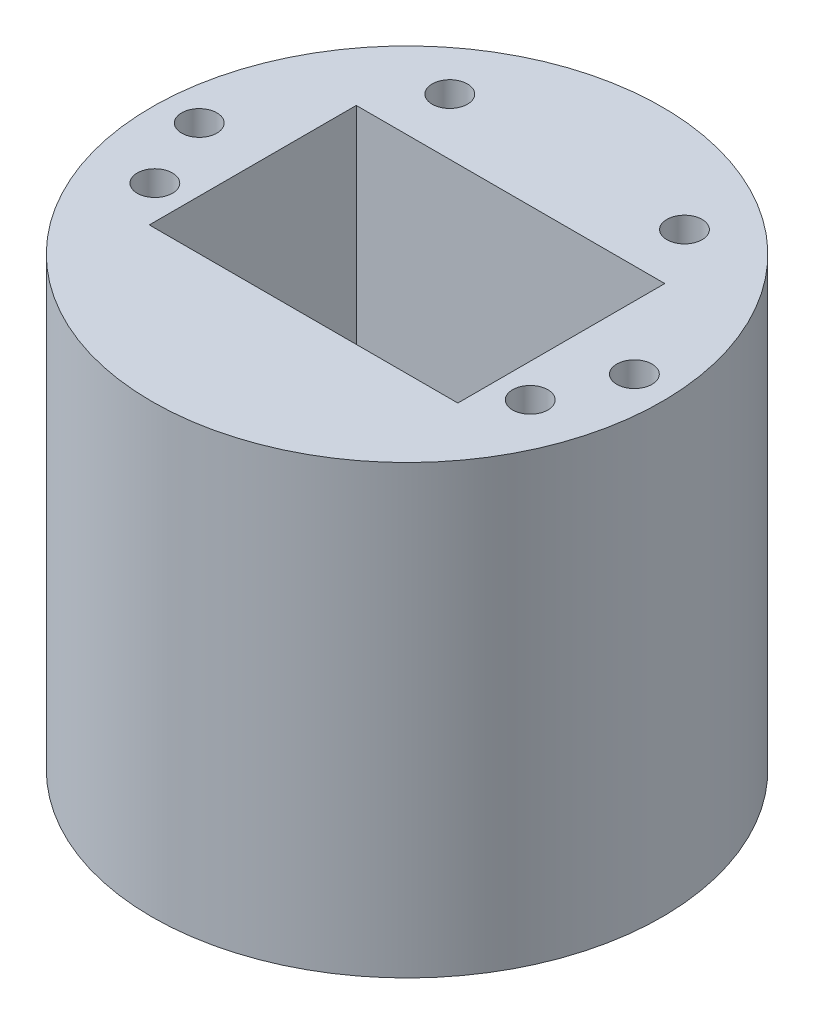
ISO-10303-21;
HEADER;
FILE_DESCRIPTION(('STEP AP214'),'2;1');
FILE_NAME('part.step','',(''),(''),'','','');
FILE_SCHEMA(('AUTOMOTIVE_DESIGN { 1 0 10303 214 1 1 1 1 }'));
ENDSEC;
DATA;
#1=APPLICATION_CONTEXT('core data for automotive mechanical design processes');
#2=APPLICATION_PROTOCOL_DEFINITION('international standard','automotive_design',2000,#1);
#3=PRODUCT_CONTEXT('',#1,'mechanical');
#4=PRODUCT('Part','Part','',(#3));
#5=PRODUCT_RELATED_PRODUCT_CATEGORY('part','',(#4));
#6=PRODUCT_DEFINITION_FORMATION('','',#4);
#7=PRODUCT_DEFINITION_CONTEXT('part definition',#1,'design');
#8=PRODUCT_DEFINITION('design','',#6,#7);
#9=PRODUCT_DEFINITION_SHAPE('','',#8);
#10=(LENGTH_UNIT() NAMED_UNIT(*) SI_UNIT(.MILLI.,.METRE.));
#11=(NAMED_UNIT(*) PLANE_ANGLE_UNIT() SI_UNIT($,.RADIAN.));
#12=(NAMED_UNIT(*) SI_UNIT($,.STERADIAN.) SOLID_ANGLE_UNIT());
#13=UNCERTAINTY_MEASURE_WITH_UNIT(LENGTH_MEASURE(1.E-05),#10,'distance_accuracy_value','');
#14=(GEOMETRIC_REPRESENTATION_CONTEXT(3) GLOBAL_UNCERTAINTY_ASSIGNED_CONTEXT((#13)) GLOBAL_UNIT_ASSIGNED_CONTEXT((#10,
#11,#12)) REPRESENTATION_CONTEXT('',''));
#15=CARTESIAN_POINT('',(0.,0.,0.));
#16=DIRECTION('',(0.,0.,1.));
#17=DIRECTION('',(1.,0.,0.));
#18=AXIS2_PLACEMENT_3D('',#15,#16,#17);
#19=CARTESIAN_POINT('',(37.0004748256233,88.,12.7186187483685));
#20=DIRECTION('',(0.,-1.,0.));
#21=DIRECTION('',(0.,0.,-1.));
#22=AXIS2_PLACEMENT_3D('',#19,#20,#21);
#23=CYLINDRICAL_SURFACE('',#22,3.475);
#24=CARTESIAN_POINT('',(37.0004748256233,88.,12.7186187483685));
#25=DIRECTION('',(0.,1.,0.));
#26=DIRECTION('',(0.,0.,1.));
#27=AXIS2_PLACEMENT_3D('',#24,#25,#26);
#28=CIRCLE('',#27,3.475);
#29=CARTESIAN_POINT('',(37.0004748256233,88.,16.1936187483685));
#30=VERTEX_POINT('',#29);
#31=EDGE_CURVE('E50',#30,#30,#28,.F.);
#32=ORIENTED_EDGE('',*,*,#31,.F.);
#33=EDGE_LOOP('',(#32));
#34=FACE_BOUND('',#33,.T.);
#35=CARTESIAN_POINT('',(37.0004748256233,0.,12.7186187483685));
#36=DIRECTION('',(0.,1.,0.));
#37=DIRECTION('',(0.,0.,1.));
#38=AXIS2_PLACEMENT_3D('',#35,#36,#37);
#39=CIRCLE('',#38,3.475);
#40=CARTESIAN_POINT('',(37.0004748256233,0.,16.1936187483685));
#41=VERTEX_POINT('',#40);
#42=EDGE_CURVE('E207',#41,#41,#39,.F.);
#43=ORIENTED_EDGE('',*,*,#42,.T.);
#44=EDGE_LOOP('',(#43));
#45=FACE_BOUND('',#44,.T.);
#46=ADVANCED_FACE('F41',(#34,#45),#23,.F.);
#47=CARTESIAN_POINT('',(-23.1297303627879,88.,-31.5565203013999));
#48=DIRECTION('',(0.,-1.,0.));
#49=DIRECTION('',(0.,0.,-1.));
#50=AXIS2_PLACEMENT_3D('',#47,#48,#49);
#51=CYLINDRICAL_SURFACE('',#50,3.475);
#52=CARTESIAN_POINT('',(-23.1297303627879,88.,-31.5565203013999));
#53=DIRECTION('',(0.,1.,0.));
#54=DIRECTION('',(0.,0.,1.));
#55=AXIS2_PLACEMENT_3D('',#52,#53,#54);
#56=CIRCLE('',#55,3.475);
#57=CARTESIAN_POINT('',(-23.1297303627879,88.,-28.0815203013999));
#58=VERTEX_POINT('',#57);
#59=EDGE_CURVE('E189',#58,#58,#56,.T.);
#60=ORIENTED_EDGE('',*,*,#59,.T.);
#61=EDGE_LOOP('',(#60));
#62=FACE_BOUND('',#61,.T.);
#63=CARTESIAN_POINT('',(-23.1297303627879,0.,-31.5565203013999));
#64=DIRECTION('',(0.,1.,0.));
#65=DIRECTION('',(0.,0.,1.));
#66=AXIS2_PLACEMENT_3D('',#63,#64,#65);
#67=CIRCLE('',#66,3.475);
#68=CARTESIAN_POINT('',(-23.1297303627879,0.,-28.0815203013999));
#69=VERTEX_POINT('',#68);
#70=EDGE_CURVE('E205',#69,#69,#67,.T.);
#71=ORIENTED_EDGE('',*,*,#70,.F.);
#72=EDGE_LOOP('',(#71));
#73=FACE_BOUND('',#72,.T.);
#74=ADVANCED_FACE('F235',(#62,#73),#51,.F.);
#75=CARTESIAN_POINT('',(-37.0004748256233,88.,12.7186187483685));
#76=DIRECTION('',(0.,-1.,0.));
#77=DIRECTION('',(0.,0.,-1.));
#78=AXIS2_PLACEMENT_3D('',#75,#76,#77);
#79=CYLINDRICAL_SURFACE('',#78,3.475);
#80=CARTESIAN_POINT('',(-37.0004748256233,88.,12.7186187483685));
#81=DIRECTION('',(0.,1.,0.));
#82=DIRECTION('',(0.,0.,1.));
#83=AXIS2_PLACEMENT_3D('',#80,#81,#82);
#84=CIRCLE('',#83,3.475);
#85=CARTESIAN_POINT('',(-37.0004748256233,88.,16.1936187483685));
#86=VERTEX_POINT('',#85);
#87=EDGE_CURVE('E186',#86,#86,#84,.T.);
#88=ORIENTED_EDGE('',*,*,#87,.T.);
#89=EDGE_LOOP('',(#88));
#90=FACE_BOUND('',#89,.T.);
#91=CARTESIAN_POINT('',(-37.0004748256233,0.,12.7186187483685));
#92=DIRECTION('',(0.,1.,0.));
#93=DIRECTION('',(0.,0.,1.));
#94=AXIS2_PLACEMENT_3D('',#91,#92,#93);
#95=CIRCLE('',#94,3.475);
#96=CARTESIAN_POINT('',(-37.0004748256233,0.,16.1936187483685));
#97=VERTEX_POINT('',#96);
#98=EDGE_CURVE('E202',#97,#97,#95,.T.);
#99=ORIENTED_EDGE('',*,*,#98,.F.);
#100=EDGE_LOOP('',(#99));
#101=FACE_BOUND('',#100,.T.);
#102=ADVANCED_FACE('F241',(#90,#101),#79,.F.);
#103=CARTESIAN_POINT('',(-42.8868203559517,88.,-1.92497785865903));
#104=DIRECTION('',(0.,-1.,0.));
#105=DIRECTION('',(0.,0.,-1.));
#106=AXIS2_PLACEMENT_3D('',#103,#104,#105);
#107=CYLINDRICAL_SURFACE('',#106,3.475);
#108=CARTESIAN_POINT('',(-42.8868203559517,88.,-1.92497785865903));
#109=DIRECTION('',(0.,1.,0.));
#110=DIRECTION('',(0.,0.,1.));
#111=AXIS2_PLACEMENT_3D('',#108,#109,#110);
#112=CIRCLE('',#111,3.475);
#113=CARTESIAN_POINT('',(-42.8868203559517,88.,1.55002214134097));
#114=VERTEX_POINT('',#113);
#115=EDGE_CURVE('E183',#114,#114,#112,.T.);
#116=ORIENTED_EDGE('',*,*,#115,.T.);
#117=EDGE_LOOP('',(#116));
#118=FACE_BOUND('',#117,.T.);
#119=CARTESIAN_POINT('',(-42.8868203559517,0.,-1.92497785865903));
#120=DIRECTION('',(0.,1.,0.));
#121=DIRECTION('',(0.,0.,1.));
#122=AXIS2_PLACEMENT_3D('',#119,#120,#121);
#123=CIRCLE('',#122,3.475);
#124=CARTESIAN_POINT('',(-42.8868203559517,0.,1.55002214134097));
#125=VERTEX_POINT('',#124);
#126=EDGE_CURVE('E199',#125,#125,#123,.T.);
#127=ORIENTED_EDGE('',*,*,#126,.F.);
#128=EDGE_LOOP('',(#127));
#129=FACE_BOUND('',#128,.T.);
#130=ADVANCED_FACE('F248',(#118,#129),#107,.F.);
#131=CARTESIAN_POINT('',(0.,88.,0.));
#132=DIRECTION('',(0.,-1.,0.));
#133=DIRECTION('',(0.,0.,-1.));
#134=AXIS2_PLACEMENT_3D('',#131,#132,#133);
#135=CYLINDRICAL_SURFACE('',#134,50.292);
#136=CARTESIAN_POINT('',(0.,88.,0.));
#137=DIRECTION('',(0.,1.,0.));
#138=DIRECTION('',(0.,0.,1.));
#139=AXIS2_PLACEMENT_3D('',#136,#137,#138);
#140=CIRCLE('',#139,50.292);
#141=CARTESIAN_POINT('',(0.,88.,50.292));
#142=VERTEX_POINT('',#141);
#143=EDGE_CURVE('E180',#142,#142,#140,.T.);
#144=ORIENTED_EDGE('',*,*,#143,.F.);
#145=EDGE_LOOP('',(#144));
#146=FACE_BOUND('',#145,.T.);
#147=CARTESIAN_POINT('',(0.,0.,0.));
#148=DIRECTION('',(0.,1.,0.));
#149=DIRECTION('',(0.,0.,1.));
#150=AXIS2_PLACEMENT_3D('',#147,#148,#149);
#151=CIRCLE('',#150,50.292);
#152=CARTESIAN_POINT('',(0.,0.,50.292));
#153=VERTEX_POINT('',#152);
#154=EDGE_CURVE('E196',#153,#153,#151,.T.);
#155=ORIENTED_EDGE('',*,*,#154,.T.);
#156=EDGE_LOOP('',(#155));
#157=FACE_BOUND('',#156,.T.);
#158=ADVANCED_FACE('F251',(#146,#157),#135,.T.);
#159=CARTESIAN_POINT('',(42.8868203559517,88.,-1.92497785865903));
#160=DIRECTION('',(0.,-1.,0.));
#161=DIRECTION('',(0.,0.,-1.));
#162=AXIS2_PLACEMENT_3D('',#159,#160,#161);
#163=CYLINDRICAL_SURFACE('',#162,3.475);
#164=CARTESIAN_POINT('',(42.8868203559517,88.,-1.92497785865903));
#165=DIRECTION('',(0.,1.,0.));
#166=DIRECTION('',(0.,0.,1.));
#167=AXIS2_PLACEMENT_3D('',#164,#165,#166);
#168=CIRCLE('',#167,3.475);
#169=CARTESIAN_POINT('',(42.8868203559517,88.,1.55002214134097));
#170=VERTEX_POINT('',#169);
#171=EDGE_CURVE('E177',#170,#170,#168,.F.);
#172=ORIENTED_EDGE('',*,*,#171,.F.);
#173=EDGE_LOOP('',(#172));
#174=FACE_BOUND('',#173,.T.);
#175=CARTESIAN_POINT('',(42.8868203559517,0.,-1.92497785865903));
#176=DIRECTION('',(0.,1.,0.));
#177=DIRECTION('',(0.,0.,1.));
#178=AXIS2_PLACEMENT_3D('',#175,#176,#177);
#179=CIRCLE('',#178,3.475);
#180=CARTESIAN_POINT('',(42.8868203559517,0.,1.55002214134097));
#181=VERTEX_POINT('',#180);
#182=EDGE_CURVE('E171',#181,#181,#179,.F.);
#183=ORIENTED_EDGE('',*,*,#182,.T.);
#184=EDGE_LOOP('',(#183));
#185=FACE_BOUND('',#184,.T.);
#186=ADVANCED_FACE('F43',(#174,#185),#163,.F.);
#187=CARTESIAN_POINT('',(23.1297303627879,88.,-31.5565203013999));
#188=DIRECTION('',(0.,-1.,0.));
#189=DIRECTION('',(0.,0.,-1.));
#190=AXIS2_PLACEMENT_3D('',#187,#188,#189);
#191=CYLINDRICAL_SURFACE('',#190,3.475);
#192=CARTESIAN_POINT('',(23.1297303627879,88.,-31.5565203013999));
#193=DIRECTION('',(0.,1.,0.));
#194=DIRECTION('',(0.,0.,1.));
#195=AXIS2_PLACEMENT_3D('',#192,#193,#194);
#196=CIRCLE('',#195,3.475);
#197=CARTESIAN_POINT('',(23.1297303627879,88.,-28.0815203013999));
#198=VERTEX_POINT('',#197);
#199=EDGE_CURVE('E11',#198,#198,#196,.F.);
#200=ORIENTED_EDGE('',*,*,#199,.F.);
#201=EDGE_LOOP('',(#200));
#202=FACE_BOUND('',#201,.T.);
#203=CARTESIAN_POINT('',(23.1297303627879,0.,-31.5565203013999));
#204=DIRECTION('',(0.,1.,0.));
#205=DIRECTION('',(0.,0.,1.));
#206=AXIS2_PLACEMENT_3D('',#203,#204,#205);
#207=CIRCLE('',#206,3.475);
#208=CARTESIAN_POINT('',(23.1297303627879,0.,-28.0815203013999));
#209=VERTEX_POINT('',#208);
#210=EDGE_CURVE('E45',#209,#209,#207,.F.);
#211=ORIENTED_EDGE('',*,*,#210,.T.);
#212=EDGE_LOOP('',(#211));
#213=FACE_BOUND('',#212,.T.);
#214=ADVANCED_FACE('F214',(#202,#213),#191,.F.);
#215=CARTESIAN_POINT('',(0.,88.,0.));
#216=DIRECTION('',(0.,1.,0.));
#217=DIRECTION('',(0.,0.,1.));
#218=AXIS2_PLACEMENT_3D('',#215,#216,#217);
#219=PLANE('',#218);
#220=DIRECTION('',(-1.,0.,0.));
#221=VECTOR('',#220,1.);
#222=CARTESIAN_POINT('',(30.411054643993,88.,-20.400011123166));
#223=LINE('',#222,#221);
#224=CARTESIAN_POINT('',(30.411054643993,88.,-20.400011123166));
#225=VERTEX_POINT('',#224);
#226=CARTESIAN_POINT('',(-30.411054643993,88.,-20.400011123166));
#227=VERTEX_POINT('',#226);
#228=EDGE_CURVE('E66',#225,#227,#223,.T.);
#229=ORIENTED_EDGE('',*,*,#228,.F.);
#230=DIRECTION('',(0.,0.,-1.));
#231=VECTOR('',#230,1.);
#232=CARTESIAN_POINT('',(30.411054643993,88.,20.400011123166));
#233=LINE('',#232,#231);
#234=CARTESIAN_POINT('',(30.411054643993,88.,20.400011123166));
#235=VERTEX_POINT('',#234);
#236=EDGE_CURVE('E150',#235,#225,#233,.T.);
#237=ORIENTED_EDGE('',*,*,#236,.F.);
#238=DIRECTION('',(1.,0.,0.));
#239=VECTOR('',#238,1.);
#240=CARTESIAN_POINT('',(-30.411054643993,88.,20.400011123166));
#241=LINE('',#240,#239);
#242=CARTESIAN_POINT('',(-30.411054643993,88.,20.400011123166));
#243=VERTEX_POINT('',#242);
#244=EDGE_CURVE('E164',#243,#235,#241,.T.);
#245=ORIENTED_EDGE('',*,*,#244,.F.);
#246=DIRECTION('',(0.,0.,1.));
#247=VECTOR('',#246,1.);
#248=CARTESIAN_POINT('',(-30.411054643993,88.,-20.400011123166));
#249=LINE('',#248,#247);
#250=EDGE_CURVE('E161',#227,#243,#249,.T.);
#251=ORIENTED_EDGE('',*,*,#250,.F.);
#252=EDGE_LOOP('',(#229,#237,#245,#251));
#253=FACE_BOUND('',#252,.T.);
#254=ORIENTED_EDGE('',*,*,#171,.T.);
#255=EDGE_LOOP('',(#254));
#256=FACE_BOUND('',#255,.T.);
#257=ORIENTED_EDGE('',*,*,#143,.T.);
#258=EDGE_LOOP('',(#257));
#259=FACE_BOUND('',#258,.T.);
#260=ORIENTED_EDGE('',*,*,#115,.F.);
#261=EDGE_LOOP('',(#260));
#262=FACE_BOUND('',#261,.T.);
#263=ORIENTED_EDGE('',*,*,#87,.F.);
#264=EDGE_LOOP('',(#263));
#265=FACE_BOUND('',#264,.T.);
#266=ORIENTED_EDGE('',*,*,#59,.F.);
#267=EDGE_LOOP('',(#266));
#268=FACE_BOUND('',#267,.T.);
#269=ORIENTED_EDGE('',*,*,#31,.T.);
#270=EDGE_LOOP('',(#269));
#271=FACE_BOUND('',#270,.T.);
#272=ORIENTED_EDGE('',*,*,#199,.T.);
#273=EDGE_LOOP('',(#272));
#274=FACE_BOUND('',#273,.T.);
#275=ADVANCED_FACE('F219',(#253,#256,#259,#262,#265,#268,#271,#274),#219,.T.);
#276=CARTESIAN_POINT('',(0.,0.,0.));
#277=DIRECTION('',(0.,1.,0.));
#278=DIRECTION('',(0.,0.,1.));
#279=AXIS2_PLACEMENT_3D('',#276,#277,#278);
#280=PLANE('',#279);
#281=DIRECTION('',(-1.,0.,0.));
#282=VECTOR('',#281,1.);
#283=CARTESIAN_POINT('',(-24.5095333354755,0.,10.4238141839846));
#284=LINE('',#283,#282);
#285=CARTESIAN_POINT('',(24.5095333354755,0.,10.4238141839846));
#286=VERTEX_POINT('',#285);
#287=CARTESIAN_POINT('',(-24.5095333354755,0.,10.4238141839846));
#288=VERTEX_POINT('',#287);
#289=EDGE_CURVE('E137',#286,#288,#284,.T.);
#290=ORIENTED_EDGE('',*,*,#289,.F.);
#291=DIRECTION('',(0.,0.,1.));
#292=VECTOR('',#291,1.);
#293=CARTESIAN_POINT('',(24.5095333354755,0.,-10.4238141839846));
#294=LINE('',#293,#292);
#295=CARTESIAN_POINT('',(24.5095333354755,0.,-10.4238141839846));
#296=VERTEX_POINT('',#295);
#297=EDGE_CURVE('E58',#296,#286,#294,.T.);
#298=ORIENTED_EDGE('',*,*,#297,.F.);
#299=DIRECTION('',(1.,0.,0.));
#300=VECTOR('',#299,1.);
#301=CARTESIAN_POINT('',(-24.5095333354755,0.,-10.4238141839846));
#302=LINE('',#301,#300);
#303=CARTESIAN_POINT('',(-24.5095333354755,0.,-10.4238141839846));
#304=VERTEX_POINT('',#303);
#305=EDGE_CURVE('E128',#304,#296,#302,.T.);
#306=ORIENTED_EDGE('',*,*,#305,.F.);
#307=DIRECTION('',(0.,0.,-1.));
#308=VECTOR('',#307,1.);
#309=CARTESIAN_POINT('',(-24.5095333354755,0.,-10.4238141839846));
#310=LINE('',#309,#308);
#311=EDGE_CURVE('E131',#288,#304,#310,.T.);
#312=ORIENTED_EDGE('',*,*,#311,.F.);
#313=EDGE_LOOP('',(#290,#298,#306,#312));
#314=FACE_BOUND('',#313,.T.);
#315=ORIENTED_EDGE('',*,*,#182,.F.);
#316=EDGE_LOOP('',(#315));
#317=FACE_BOUND('',#316,.T.);
#318=ORIENTED_EDGE('',*,*,#154,.F.);
#319=EDGE_LOOP('',(#318));
#320=FACE_BOUND('',#319,.T.);
#321=ORIENTED_EDGE('',*,*,#126,.T.);
#322=EDGE_LOOP('',(#321));
#323=FACE_BOUND('',#322,.T.);
#324=ORIENTED_EDGE('',*,*,#98,.T.);
#325=EDGE_LOOP('',(#324));
#326=FACE_BOUND('',#325,.T.);
#327=ORIENTED_EDGE('',*,*,#70,.T.);
#328=EDGE_LOOP('',(#327));
#329=FACE_BOUND('',#328,.T.);
#330=ORIENTED_EDGE('',*,*,#42,.F.);
#331=EDGE_LOOP('',(#330));
#332=FACE_BOUND('',#331,.T.);
#333=ORIENTED_EDGE('',*,*,#210,.F.);
#334=EDGE_LOOP('',(#333));
#335=FACE_BOUND('',#334,.T.);
#336=ADVANCED_FACE('F216',(#314,#317,#320,#323,#326,#329,#332,#335),#280,.F.);
#337=CARTESIAN_POINT('',(30.411054643993,19.96,-20.400011123166));
#338=DIRECTION('',(0.,0.,-1.));
#339=DIRECTION('',(-1.,0.,0.));
#340=AXIS2_PLACEMENT_3D('',#337,#338,#339);
#341=PLANE('',#340);
#342=ORIENTED_EDGE('',*,*,#228,.T.);
#343=DIRECTION('',(0.,1.,0.));
#344=VECTOR('',#343,1.);
#345=CARTESIAN_POINT('',(-30.411054643993,19.96,-20.400011123166));
#346=LINE('',#345,#344);
#347=CARTESIAN_POINT('',(-30.411054643993,19.96,-20.400011123166));
#348=VERTEX_POINT('',#347);
#349=EDGE_CURVE('E159',#348,#227,#346,.T.);
#350=ORIENTED_EDGE('',*,*,#349,.F.);
#351=DIRECTION('',(-1.,0.,0.));
#352=VECTOR('',#351,1.);
#353=CARTESIAN_POINT('',(30.411054643993,19.96,-20.400011123166));
#354=LINE('',#353,#352);
#355=CARTESIAN_POINT('',(30.411054643993,19.96,-20.400011123166));
#356=VERTEX_POINT('',#355);
#357=EDGE_CURVE('E146',#356,#348,#354,.T.);
#358=ORIENTED_EDGE('',*,*,#357,.F.);
#359=DIRECTION('',(0.,1.,0.));
#360=VECTOR('',#359,1.);
#361=CARTESIAN_POINT('',(30.411054643993,19.96,-20.400011123166));
#362=LINE('',#361,#360);
#363=EDGE_CURVE('E169',#356,#225,#362,.T.);
#364=ORIENTED_EDGE('',*,*,#363,.T.);
#365=EDGE_LOOP('',(#342,#350,#358,#364));
#366=FACE_BOUND('',#365,.T.);
#367=ADVANCED_FACE('F218',(#366),#341,.F.);
#368=CARTESIAN_POINT('',(30.411054643993,19.96,20.400011123166));
#369=DIRECTION('',(1.,0.,0.));
#370=DIRECTION('',(0.,0.,-1.));
#371=AXIS2_PLACEMENT_3D('',#368,#369,#370);
#372=PLANE('',#371);
#373=ORIENTED_EDGE('',*,*,#236,.T.);
#374=ORIENTED_EDGE('',*,*,#363,.F.);
#375=DIRECTION('',(0.,0.,-1.));
#376=VECTOR('',#375,1.);
#377=CARTESIAN_POINT('',(30.411054643993,19.96,20.400011123166));
#378=LINE('',#377,#376);
#379=CARTESIAN_POINT('',(30.411054643993,19.96,20.400011123166));
#380=VERTEX_POINT('',#379);
#381=EDGE_CURVE('E156',#380,#356,#378,.T.);
#382=ORIENTED_EDGE('',*,*,#381,.F.);
#383=DIRECTION('',(0.,1.,0.));
#384=VECTOR('',#383,1.);
#385=CARTESIAN_POINT('',(30.411054643993,19.96,20.400011123166));
#386=LINE('',#385,#384);
#387=EDGE_CURVE('E172',#380,#235,#386,.T.);
#388=ORIENTED_EDGE('',*,*,#387,.T.);
#389=EDGE_LOOP('',(#373,#374,#382,#388));
#390=FACE_BOUND('',#389,.T.);
#391=ADVANCED_FACE('F227',(#390),#372,.F.);
#392=CARTESIAN_POINT('',(-30.411054643993,19.96,20.400011123166));
#393=DIRECTION('',(0.,0.,1.));
#394=DIRECTION('',(1.,0.,0.));
#395=AXIS2_PLACEMENT_3D('',#392,#393,#394);
#396=PLANE('',#395);
#397=ORIENTED_EDGE('',*,*,#244,.T.);
#398=ORIENTED_EDGE('',*,*,#387,.F.);
#399=DIRECTION('',(1.,0.,0.));
#400=VECTOR('',#399,1.);
#401=CARTESIAN_POINT('',(-30.411054643993,19.96,20.400011123166));
#402=LINE('',#401,#400);
#403=CARTESIAN_POINT('',(-30.411054643993,19.96,20.400011123166));
#404=VERTEX_POINT('',#403);
#405=EDGE_CURVE('E153',#404,#380,#402,.T.);
#406=ORIENTED_EDGE('',*,*,#405,.F.);
#407=DIRECTION('',(0.,1.,0.));
#408=VECTOR('',#407,1.);
#409=CARTESIAN_POINT('',(-30.411054643993,19.96,20.400011123166));
#410=LINE('',#409,#408);
#411=EDGE_CURVE('E174',#404,#243,#410,.T.);
#412=ORIENTED_EDGE('',*,*,#411,.T.);
#413=EDGE_LOOP('',(#397,#398,#406,#412));
#414=FACE_BOUND('',#413,.T.);
#415=ADVANCED_FACE('F306',(#414),#396,.F.);
#416=CARTESIAN_POINT('',(-30.411054643993,19.96,-20.400011123166));
#417=DIRECTION('',(-1.,0.,0.));
#418=DIRECTION('',(0.,0.,1.));
#419=AXIS2_PLACEMENT_3D('',#416,#417,#418);
#420=PLANE('',#419);
#421=ORIENTED_EDGE('',*,*,#250,.T.);
#422=ORIENTED_EDGE('',*,*,#411,.F.);
#423=DIRECTION('',(0.,0.,1.));
#424=VECTOR('',#423,1.);
#425=CARTESIAN_POINT('',(-30.411054643993,19.96,-20.400011123166));
#426=LINE('',#425,#424);
#427=EDGE_CURVE('E149',#348,#404,#426,.T.);
#428=ORIENTED_EDGE('',*,*,#427,.F.);
#429=ORIENTED_EDGE('',*,*,#349,.T.);
#430=EDGE_LOOP('',(#421,#422,#428,#429));
#431=FACE_BOUND('',#430,.T.);
#432=ADVANCED_FACE('F315',(#431),#420,.F.);
#433=CARTESIAN_POINT('',(0.,19.96,0.));
#434=DIRECTION('',(0.,1.,0.));
#435=DIRECTION('',(0.,0.,1.));
#436=AXIS2_PLACEMENT_3D('',#433,#434,#435);
#437=PLANE('',#436);
#438=ORIENTED_EDGE('',*,*,#357,.T.);
#439=ORIENTED_EDGE('',*,*,#427,.T.);
#440=ORIENTED_EDGE('',*,*,#405,.T.);
#441=ORIENTED_EDGE('',*,*,#381,.T.);
#442=EDGE_LOOP('',(#438,#439,#440,#441));
#443=FACE_BOUND('',#442,.T.);
#444=ADVANCED_FACE('F323',(#443),#437,.T.);
#445=CARTESIAN_POINT('',(24.5095333354755,12.,-10.4238141839846));
#446=DIRECTION('',(1.,0.,0.));
#447=DIRECTION('',(0.,0.,-1.));
#448=AXIS2_PLACEMENT_3D('',#445,#446,#447);
#449=PLANE('',#448);
#450=ORIENTED_EDGE('',*,*,#297,.T.);
#451=DIRECTION('',(0.,-1.,0.));
#452=VECTOR('',#451,1.);
#453=CARTESIAN_POINT('',(24.5095333354755,12.,10.4238141839846));
#454=LINE('',#453,#452);
#455=CARTESIAN_POINT('',(24.5095333354755,12.,10.4238141839846));
#456=VERTEX_POINT('',#455);
#457=EDGE_CURVE('E106',#456,#286,#454,.T.);
#458=ORIENTED_EDGE('',*,*,#457,.F.);
#459=DIRECTION('',(0.,0.,1.));
#460=VECTOR('',#459,1.);
#461=CARTESIAN_POINT('',(24.5095333354755,12.,-10.4238141839846));
#462=LINE('',#461,#460);
#463=CARTESIAN_POINT('',(24.5095333354755,12.,-10.4238141839846));
#464=VERTEX_POINT('',#463);
#465=EDGE_CURVE('E110',#464,#456,#462,.T.);
#466=ORIENTED_EDGE('',*,*,#465,.F.);
#467=DIRECTION('',(0.,-1.,0.));
#468=VECTOR('',#467,1.);
#469=CARTESIAN_POINT('',(24.5095333354755,12.,-10.4238141839846));
#470=LINE('',#469,#468);
#471=EDGE_CURVE('E141',#464,#296,#470,.T.);
#472=ORIENTED_EDGE('',*,*,#471,.T.);
#473=EDGE_LOOP('',(#450,#458,#466,#472));
#474=FACE_BOUND('',#473,.T.);
#475=ADVANCED_FACE('F108',(#474),#449,.F.);
#476=CARTESIAN_POINT('',(-24.5095333354755,12.,-10.4238141839846));
#477=DIRECTION('',(0.,0.,-1.));
#478=DIRECTION('',(-1.,0.,0.));
#479=AXIS2_PLACEMENT_3D('',#476,#477,#478);
#480=PLANE('',#479);
#481=ORIENTED_EDGE('',*,*,#305,.T.);
#482=ORIENTED_EDGE('',*,*,#471,.F.);
#483=DIRECTION('',(1.,0.,0.));
#484=VECTOR('',#483,1.);
#485=CARTESIAN_POINT('',(-24.5095333354755,12.,-10.4238141839846));
#486=LINE('',#485,#484);
#487=CARTESIAN_POINT('',(-24.5095333354755,12.,-10.4238141839846));
#488=VERTEX_POINT('',#487);
#489=EDGE_CURVE('E116',#488,#464,#486,.T.);
#490=ORIENTED_EDGE('',*,*,#489,.F.);
#491=DIRECTION('',(0.,-1.,0.));
#492=VECTOR('',#491,1.);
#493=CARTESIAN_POINT('',(-24.5095333354755,12.,-10.4238141839846));
#494=LINE('',#493,#492);
#495=EDGE_CURVE('E143',#488,#304,#494,.T.);
#496=ORIENTED_EDGE('',*,*,#495,.T.);
#497=EDGE_LOOP('',(#481,#482,#490,#496));
#498=FACE_BOUND('',#497,.T.);
#499=ADVANCED_FACE('F342',(#498),#480,.F.);
#500=CARTESIAN_POINT('',(-24.5095333354755,12.,-10.4238141839846));
#501=DIRECTION('',(-1.,0.,0.));
#502=DIRECTION('',(0.,0.,1.));
#503=AXIS2_PLACEMENT_3D('',#500,#501,#502);
#504=PLANE('',#503);
#505=ORIENTED_EDGE('',*,*,#311,.T.);
#506=ORIENTED_EDGE('',*,*,#495,.F.);
#507=DIRECTION('',(0.,0.,-1.));
#508=VECTOR('',#507,1.);
#509=CARTESIAN_POINT('',(-24.5095333354755,12.,-10.4238141839846));
#510=LINE('',#509,#508);
#511=CARTESIAN_POINT('',(-24.5095333354755,12.,10.4238141839846));
#512=VERTEX_POINT('',#511);
#513=EDGE_CURVE('E124',#512,#488,#510,.T.);
#514=ORIENTED_EDGE('',*,*,#513,.F.);
#515=DIRECTION('',(0.,-1.,0.));
#516=VECTOR('',#515,1.);
#517=CARTESIAN_POINT('',(-24.5095333354755,12.,10.4238141839846));
#518=LINE('',#517,#516);
#519=EDGE_CURVE('E115',#512,#288,#518,.T.);
#520=ORIENTED_EDGE('',*,*,#519,.T.);
#521=EDGE_LOOP('',(#505,#506,#514,#520));
#522=FACE_BOUND('',#521,.T.);
#523=ADVANCED_FACE('F351',(#522),#504,.F.);
#524=CARTESIAN_POINT('',(-24.5095333354755,12.,10.4238141839846));
#525=DIRECTION('',(0.,0.,1.));
#526=DIRECTION('',(1.,0.,0.));
#527=AXIS2_PLACEMENT_3D('',#524,#525,#526);
#528=PLANE('',#527);
#529=ORIENTED_EDGE('',*,*,#289,.T.);
#530=ORIENTED_EDGE('',*,*,#519,.F.);
#531=DIRECTION('',(-1.,0.,0.));
#532=VECTOR('',#531,1.);
#533=CARTESIAN_POINT('',(-24.5095333354755,12.,10.4238141839846));
#534=LINE('',#533,#532);
#535=EDGE_CURVE('E119',#456,#512,#534,.T.);
#536=ORIENTED_EDGE('',*,*,#535,.F.);
#537=ORIENTED_EDGE('',*,*,#457,.T.);
#538=EDGE_LOOP('',(#529,#530,#536,#537));
#539=FACE_BOUND('',#538,.T.);
#540=ADVANCED_FACE('F120',(#539),#528,.F.);
#541=CARTESIAN_POINT('',(0.,12.,0.));
#542=DIRECTION('',(0.,1.,0.));
#543=DIRECTION('',(0.,0.,1.));
#544=AXIS2_PLACEMENT_3D('',#541,#542,#543);
#545=PLANE('',#544);
#546=ORIENTED_EDGE('',*,*,#465,.T.);
#547=ORIENTED_EDGE('',*,*,#535,.T.);
#548=ORIENTED_EDGE('',*,*,#513,.T.);
#549=ORIENTED_EDGE('',*,*,#489,.T.);
#550=EDGE_LOOP('',(#546,#547,#548,#549));
#551=FACE_BOUND('',#550,.T.);
#552=ADVANCED_FACE('F126',(#551),#545,.F.);
#553=CLOSED_SHELL('',(#46,#74,#102,#130,#158,#186,#214,#275,#336,#367,#391,#415,#432,#444,#475,
#499,#523,#540,#552));
#554=MANIFOLD_SOLID_BREP('B2',#553);
#555=ADVANCED_BREP_SHAPE_REPRESENTATION('',(#18,#554),#14);
#556=SHAPE_DEFINITION_REPRESENTATION(#9,#555);
ENDSEC;
END-ISO-10303-21;
